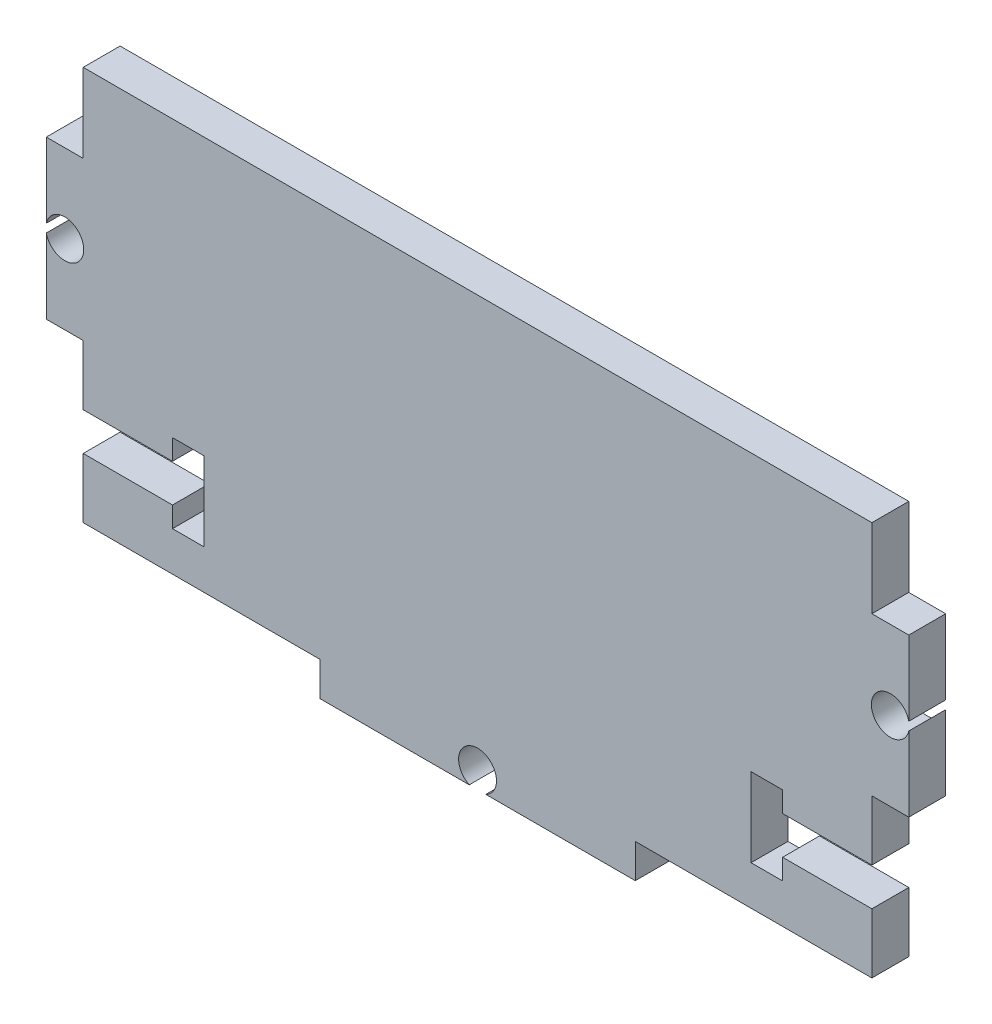
ISO-10303-21;
HEADER;
FILE_DESCRIPTION(('STEP AP214'),'2;1');
FILE_NAME('part.step','',(''),(''),'','','');
FILE_SCHEMA(('AUTOMOTIVE_DESIGN { 1 0 10303 214 1 1 1 1 }'));
ENDSEC;
DATA;
#1=APPLICATION_CONTEXT('core data for automotive mechanical design processes');
#2=APPLICATION_PROTOCOL_DEFINITION('international standard','automotive_design',2000,#1);
#3=PRODUCT_CONTEXT('',#1,'mechanical');
#4=PRODUCT('Part','Part','',(#3));
#5=PRODUCT_RELATED_PRODUCT_CATEGORY('part','',(#4));
#6=PRODUCT_DEFINITION_FORMATION('','',#4);
#7=PRODUCT_DEFINITION_CONTEXT('part definition',#1,'design');
#8=PRODUCT_DEFINITION('design','',#6,#7);
#9=PRODUCT_DEFINITION_SHAPE('','',#8);
#10=(LENGTH_UNIT() NAMED_UNIT(*) SI_UNIT(.MILLI.,.METRE.));
#11=(NAMED_UNIT(*) PLANE_ANGLE_UNIT() SI_UNIT($,.RADIAN.));
#12=(NAMED_UNIT(*) SI_UNIT($,.STERADIAN.) SOLID_ANGLE_UNIT());
#13=UNCERTAINTY_MEASURE_WITH_UNIT(LENGTH_MEASURE(1.E-05),#10,'distance_accuracy_value','');
#14=(GEOMETRIC_REPRESENTATION_CONTEXT(3) GLOBAL_UNCERTAINTY_ASSIGNED_CONTEXT((#13)) GLOBAL_UNIT_ASSIGNED_CONTEXT((#10,
#11,#12)) REPRESENTATION_CONTEXT('',''));
#15=CARTESIAN_POINT('',(0.,0.,0.));
#16=DIRECTION('',(0.,0.,1.));
#17=DIRECTION('',(1.,0.,0.));
#18=AXIS2_PLACEMENT_3D('',#15,#16,#17);
#19=CARTESIAN_POINT('',(-34.7218,0.,2.9718));
#20=DIRECTION('',(1.,0.,0.));
#21=DIRECTION('',(0.,0.,-1.));
#22=AXIS2_PLACEMENT_3D('',#19,#20,#21);
#23=PLANE('',#22);
#24=DIRECTION('',(0.,-1.,0.));
#25=VECTOR('',#24,1.);
#26=CARTESIAN_POINT('',(-34.7218,0.,2.9718));
#27=LINE('',#26,#25);
#28=CARTESIAN_POINT('',(-34.7218,2.83635979270025,2.9718));
#29=VERTEX_POINT('',#28);
#30=CARTESIAN_POINT('',(-34.7218,-3.175,2.9718));
#31=VERTEX_POINT('',#30);
#32=EDGE_CURVE('E605',#29,#31,#27,.T.);
#33=ORIENTED_EDGE('',*,*,#32,.F.);
#34=DIRECTION('',(0.,0.,-1.));
#35=VECTOR('',#34,1.);
#36=CARTESIAN_POINT('',(-34.7218,2.83635979270025,2.9718));
#37=LINE('',#36,#35);
#38=CARTESIAN_POINT('',(-34.7218,2.83635979270025,0.));
#39=VERTEX_POINT('',#38);
#40=EDGE_CURVE('E613',#29,#39,#37,.T.);
#41=ORIENTED_EDGE('',*,*,#40,.T.);
#42=DIRECTION('',(0.,-1.,0.));
#43=VECTOR('',#42,1.);
#44=CARTESIAN_POINT('',(-34.7218,0.,0.));
#45=LINE('',#44,#43);
#46=CARTESIAN_POINT('',(-34.7218,-3.175,0.));
#47=VERTEX_POINT('',#46);
#48=EDGE_CURVE('E479',#39,#47,#45,.T.);
#49=ORIENTED_EDGE('',*,*,#48,.T.);
#50=DIRECTION('',(0.,0.,-1.));
#51=VECTOR('',#50,1.);
#52=CARTESIAN_POINT('',(-34.7218,-3.175,2.9718));
#53=LINE('',#52,#51);
#54=EDGE_CURVE('E57',#31,#47,#53,.T.);
#55=ORIENTED_EDGE('',*,*,#54,.F.);
#56=EDGE_LOOP('',(#33,#41,#49,#55));
#57=FACE_BOUND('',#56,.T.);
#58=ADVANCED_FACE('F48',(#57),#23,.F.);
#59=CARTESIAN_POINT('',(-31.75,0.,2.9718));
#60=DIRECTION('',(-1.,0.,0.));
#61=DIRECTION('',(0.,-1.,0.));
#62=AXIS2_PLACEMENT_3D('',#59,#60,#61);
#63=PLANE('',#62);
#64=DIRECTION('',(0.,1.,0.));
#65=VECTOR('',#64,1.);
#66=CARTESIAN_POINT('',(-31.75,0.,2.9718));
#67=LINE('',#66,#65);
#68=CARTESIAN_POINT('',(-31.75,-15.875,2.9718));
#69=VERTEX_POINT('',#68);
#70=CARTESIAN_POINT('',(-31.75,-11.049,2.9718));
#71=VERTEX_POINT('',#70);
#72=EDGE_CURVE('E544',#69,#71,#67,.T.);
#73=ORIENTED_EDGE('',*,*,#72,.T.);
#74=DIRECTION('',(0.,0.,-1.));
#75=VECTOR('',#74,1.);
#76=CARTESIAN_POINT('',(-31.75,-11.049,2.9718));
#77=LINE('',#76,#75);
#78=CARTESIAN_POINT('',(-31.75,-11.049,0.));
#79=VERTEX_POINT('',#78);
#80=EDGE_CURVE('E797',#71,#79,#77,.T.);
#81=ORIENTED_EDGE('',*,*,#80,.T.);
#82=DIRECTION('',(0.,1.,0.));
#83=VECTOR('',#82,1.);
#84=CARTESIAN_POINT('',(-31.75,0.,0.));
#85=LINE('',#84,#83);
#86=CARTESIAN_POINT('',(-31.75,-15.875,0.));
#87=VERTEX_POINT('',#86);
#88=EDGE_CURVE('E487',#87,#79,#85,.T.);
#89=ORIENTED_EDGE('',*,*,#88,.F.);
#90=DIRECTION('',(0.,0.,-1.));
#91=VECTOR('',#90,1.);
#92=CARTESIAN_POINT('',(-31.75,-15.875,2.9718));
#93=LINE('',#92,#91);
#94=EDGE_CURVE('E458',#69,#87,#93,.T.);
#95=ORIENTED_EDGE('',*,*,#94,.F.);
#96=EDGE_LOOP('',(#73,#81,#89,#95));
#97=FACE_BOUND('',#96,.T.);
#98=ADVANCED_FACE('F622',(#97),#63,.T.);
#99=CARTESIAN_POINT('',(0.,-18.6147342531079,2.9718));
#100=DIRECTION('',(0.,1.,0.));
#101=DIRECTION('',(0.,0.,1.));
#102=AXIS2_PLACEMENT_3D('',#99,#100,#101);
#103=PLANE('',#102);
#104=DIRECTION('',(1.,0.,0.));
#105=VECTOR('',#104,1.);
#106=CARTESIAN_POINT('',(0.,-18.6147342531079,2.9718));
#107=LINE('',#106,#105);
#108=CARTESIAN_POINT('',(0.667862302864053,-18.6147342531079,2.9718));
#109=VERTEX_POINT('',#108);
#110=CARTESIAN_POINT('',(12.7,-18.6147342531079,2.9718));
#111=VERTEX_POINT('',#110);
#112=EDGE_CURVE('E822',#109,#111,#107,.T.);
#113=ORIENTED_EDGE('',*,*,#112,.F.);
#114=DIRECTION('',(0.,0.,-1.));
#115=VECTOR('',#114,1.);
#116=CARTESIAN_POINT('',(0.667862302864053,-18.6147342531079,2.9718));
#117=LINE('',#116,#115);
#118=CARTESIAN_POINT('',(0.667862302864053,-18.6147342531079,0.));
#119=VERTEX_POINT('',#118);
#120=EDGE_CURVE('E731',#109,#119,#117,.T.);
#121=ORIENTED_EDGE('',*,*,#120,.T.);
#122=DIRECTION('',(1.,0.,0.));
#123=VECTOR('',#122,1.);
#124=CARTESIAN_POINT('',(0.,-18.6147342531079,0.));
#125=LINE('',#124,#123);
#126=CARTESIAN_POINT('',(12.7,-18.6147342531079,0.));
#127=VERTEX_POINT('',#126);
#128=EDGE_CURVE('E502',#119,#127,#125,.T.);
#129=ORIENTED_EDGE('',*,*,#128,.T.);
#130=DIRECTION('',(0.,0.,-1.));
#131=VECTOR('',#130,1.);
#132=CARTESIAN_POINT('',(12.7,-18.6147342531079,2.9718));
#133=LINE('',#132,#131);
#134=EDGE_CURVE('E446',#111,#127,#133,.T.);
#135=ORIENTED_EDGE('',*,*,#134,.F.);
#136=EDGE_LOOP('',(#113,#121,#129,#135));
#137=FACE_BOUND('',#136,.T.);
#138=ADVANCED_FACE('F627',(#137),#103,.F.);
#139=CARTESIAN_POINT('',(31.75,0.,2.9718));
#140=DIRECTION('',(-1.,0.,0.));
#141=DIRECTION('',(0.,0.,1.));
#142=AXIS2_PLACEMENT_3D('',#139,#140,#141);
#143=PLANE('',#142);
#144=DIRECTION('',(0.,0.,-1.));
#145=VECTOR('',#144,1.);
#146=CARTESIAN_POINT('',(31.75,-8.00099999999999,2.9718));
#147=LINE('',#146,#145);
#148=CARTESIAN_POINT('',(31.75,-8.00099999999999,2.9718));
#149=VERTEX_POINT('',#148);
#150=CARTESIAN_POINT('',(31.75,-8.00099999999999,0.));
#151=VERTEX_POINT('',#150);
#152=EDGE_CURVE('E695',#149,#151,#147,.T.);
#153=ORIENTED_EDGE('',*,*,#152,.T.);
#154=DIRECTION('',(0.,1.,0.));
#155=VECTOR('',#154,1.);
#156=CARTESIAN_POINT('',(31.75,0.,0.));
#157=LINE('',#156,#155);
#158=CARTESIAN_POINT('',(31.75,-3.175,0.));
#159=VERTEX_POINT('',#158);
#160=EDGE_CURVE('E513',#151,#159,#157,.T.);
#161=ORIENTED_EDGE('',*,*,#160,.T.);
#162=DIRECTION('',(0.,0.,-1.));
#163=VECTOR('',#162,1.);
#164=CARTESIAN_POINT('',(31.75,-3.175,2.9718));
#165=LINE('',#164,#163);
#166=CARTESIAN_POINT('',(31.75,-3.175,2.9718));
#167=VERTEX_POINT('',#166);
#168=EDGE_CURVE('E435',#167,#159,#165,.T.);
#169=ORIENTED_EDGE('',*,*,#168,.F.);
#170=DIRECTION('',(0.,1.,0.));
#171=VECTOR('',#170,1.);
#172=CARTESIAN_POINT('',(31.75,0.,2.9718));
#173=LINE('',#172,#171);
#174=EDGE_CURVE('E549',#149,#167,#173,.T.);
#175=ORIENTED_EDGE('',*,*,#174,.F.);
#176=EDGE_LOOP('',(#153,#161,#169,#175));
#177=FACE_BOUND('',#176,.T.);
#178=ADVANCED_FACE('F870',(#177),#143,.F.);
#179=CARTESIAN_POINT('',(34.7218,0.,2.9718));
#180=DIRECTION('',(1.,0.,0.));
#181=DIRECTION('',(0.,0.,-1.));
#182=AXIS2_PLACEMENT_3D('',#179,#180,#181);
#183=PLANE('',#182);
#184=DIRECTION('',(0.,0.,-1.));
#185=VECTOR('',#184,1.);
#186=CARTESIAN_POINT('',(34.7218,2.83635979270025,2.9718));
#187=LINE('',#186,#185);
#188=CARTESIAN_POINT('',(34.7218,2.83635979270025,2.9718));
#189=VERTEX_POINT('',#188);
#190=CARTESIAN_POINT('',(34.7218,2.83635979270025,0.));
#191=VERTEX_POINT('',#190);
#192=EDGE_CURVE('E375',#189,#191,#187,.T.);
#193=ORIENTED_EDGE('',*,*,#192,.F.);
#194=DIRECTION('',(0.,-1.,0.));
#195=VECTOR('',#194,1.);
#196=CARTESIAN_POINT('',(34.7218,0.,2.9718));
#197=LINE('',#196,#195);
#198=CARTESIAN_POINT('',(34.7218,-3.175,2.9718));
#199=VERTEX_POINT('',#198);
#200=EDGE_CURVE('E849',#189,#199,#197,.T.);
#201=ORIENTED_EDGE('',*,*,#200,.T.);
#202=DIRECTION('',(0.,0.,-1.));
#203=VECTOR('',#202,1.);
#204=CARTESIAN_POINT('',(34.7218,-3.175,2.9718));
#205=LINE('',#204,#203);
#206=CARTESIAN_POINT('',(34.7218,-3.175,0.));
#207=VERTEX_POINT('',#206);
#208=EDGE_CURVE('E431',#199,#207,#205,.T.);
#209=ORIENTED_EDGE('',*,*,#208,.T.);
#210=DIRECTION('',(0.,-1.,0.));
#211=VECTOR('',#210,1.);
#212=CARTESIAN_POINT('',(34.7218,0.,0.));
#213=LINE('',#212,#211);
#214=EDGE_CURVE('E400',#191,#207,#213,.T.);
#215=ORIENTED_EDGE('',*,*,#214,.F.);
#216=EDGE_LOOP('',(#193,#201,#209,#215));
#217=FACE_BOUND('',#216,.T.);
#218=ADVANCED_FACE('F867',(#217),#183,.T.);
#219=CARTESIAN_POINT('',(0.,0.,2.9718));
#220=DIRECTION('',(0.,0.,1.));
#221=DIRECTION('',(1.,0.,0.));
#222=AXIS2_PLACEMENT_3D('',#219,#220,#221);
#223=PLANE('',#222);
#224=DIRECTION('',(0.,1.,0.));
#225=VECTOR('',#224,1.);
#226=CARTESIAN_POINT('',(-24.5618,-12.7,2.9718));
#227=LINE('',#226,#225);
#228=CARTESIAN_POINT('',(-24.5618,-12.7,2.9718));
#229=VERTEX_POINT('',#228);
#230=CARTESIAN_POINT('',(-24.5618,-11.049,2.9718));
#231=VERTEX_POINT('',#230);
#232=EDGE_CURVE('E771',#229,#231,#227,.T.);
#233=ORIENTED_EDGE('',*,*,#232,.T.);
#234=DIRECTION('',(1.,0.,0.));
#235=VECTOR('',#234,1.);
#236=CARTESIAN_POINT('',(-31.75,-11.049,2.9718));
#237=LINE('',#236,#235);
#238=EDGE_CURVE('E774',#71,#231,#237,.T.);
#239=ORIENTED_EDGE('',*,*,#238,.F.);
#240=ORIENTED_EDGE('',*,*,#72,.F.);
#241=DIRECTION('',(1.,0.,0.));
#242=VECTOR('',#241,1.);
#243=CARTESIAN_POINT('',(0.,-15.875,2.9718));
#244=LINE('',#243,#242);
#245=CARTESIAN_POINT('',(-12.7,-15.875,2.9718));
#246=VERTEX_POINT('',#245);
#247=EDGE_CURVE('E567',#69,#246,#244,.T.);
#248=ORIENTED_EDGE('',*,*,#247,.T.);
#249=DIRECTION('',(0.,-1.,0.));
#250=VECTOR('',#249,1.);
#251=CARTESIAN_POINT('',(-12.7,0.,2.9718));
#252=LINE('',#251,#250);
#253=CARTESIAN_POINT('',(-12.7,-18.6147342531079,2.9718));
#254=VERTEX_POINT('',#253);
#255=EDGE_CURVE('E823',#246,#254,#252,.T.);
#256=ORIENTED_EDGE('',*,*,#255,.T.);
#257=CARTESIAN_POINT('',(-0.667862302864053,-18.6147342531079,2.9718));
#258=VERTEX_POINT('',#257);
#259=EDGE_CURVE('E817',#254,#258,#107,.T.);
#260=ORIENTED_EDGE('',*,*,#259,.T.);
#261=CARTESIAN_POINT('',(0.,-17.2448671265539,2.9718));
#262=DIRECTION('',(0.,0.,-1.));
#263=DIRECTION('',(-1.,0.,0.));
#264=AXIS2_PLACEMENT_3D('',#261,#262,#263);
#265=CIRCLE('',#264,1.524);
#266=EDGE_CURVE('E724',#258,#109,#265,.T.);
#267=ORIENTED_EDGE('',*,*,#266,.T.);
#268=ORIENTED_EDGE('',*,*,#112,.T.);
#269=DIRECTION('',(0.,-1.,0.));
#270=VECTOR('',#269,1.);
#271=CARTESIAN_POINT('',(12.7,0.,2.9718));
#272=LINE('',#271,#270);
#273=CARTESIAN_POINT('',(12.7,-15.875,2.9718));
#274=VERTEX_POINT('',#273);
#275=EDGE_CURVE('E821',#274,#111,#272,.T.);
#276=ORIENTED_EDGE('',*,*,#275,.F.);
#277=CARTESIAN_POINT('',(31.75,-15.875,2.9718));
#278=VERTEX_POINT('',#277);
#279=EDGE_CURVE('E829',#274,#278,#244,.T.);
#280=ORIENTED_EDGE('',*,*,#279,.T.);
#281=CARTESIAN_POINT('',(31.75,-11.049,2.9718));
#282=VERTEX_POINT('',#281);
#283=EDGE_CURVE('E548',#278,#282,#173,.T.);
#284=ORIENTED_EDGE('',*,*,#283,.T.);
#285=DIRECTION('',(-1.,0.,0.));
#286=VECTOR('',#285,1.);
#287=CARTESIAN_POINT('',(0.,-11.049,2.9718));
#288=LINE('',#287,#286);
#289=CARTESIAN_POINT('',(24.5618,-11.049,2.9718));
#290=VERTEX_POINT('',#289);
#291=EDGE_CURVE('E674',#282,#290,#288,.T.);
#292=ORIENTED_EDGE('',*,*,#291,.T.);
#293=DIRECTION('',(0.,1.,0.));
#294=VECTOR('',#293,1.);
#295=CARTESIAN_POINT('',(24.5618,0.,2.9718));
#296=LINE('',#295,#294);
#297=CARTESIAN_POINT('',(24.5618,-12.7,2.9718));
#298=VERTEX_POINT('',#297);
#299=EDGE_CURVE('E678',#298,#290,#296,.T.);
#300=ORIENTED_EDGE('',*,*,#299,.F.);
#301=DIRECTION('',(1.,0.,0.));
#302=VECTOR('',#301,1.);
#303=CARTESIAN_POINT('',(0.,-12.7,2.9718));
#304=LINE('',#303,#302);
#305=CARTESIAN_POINT('',(22.0218,-12.7,2.9718));
#306=VERTEX_POINT('',#305);
#307=EDGE_CURVE('E681',#306,#298,#304,.T.);
#308=ORIENTED_EDGE('',*,*,#307,.F.);
#309=DIRECTION('',(0.,1.,0.));
#310=VECTOR('',#309,1.);
#311=CARTESIAN_POINT('',(22.0218,0.,2.9718));
#312=LINE('',#311,#310);
#313=CARTESIAN_POINT('',(22.0218,-6.34999999999999,2.9718));
#314=VERTEX_POINT('',#313);
#315=EDGE_CURVE('E684',#306,#314,#312,.T.);
#316=ORIENTED_EDGE('',*,*,#315,.T.);
#317=DIRECTION('',(1.,0.,0.));
#318=VECTOR('',#317,1.);
#319=CARTESIAN_POINT('',(0.,-6.34999999999999,2.9718));
#320=LINE('',#319,#318);
#321=CARTESIAN_POINT('',(24.5618,-6.34999999999999,2.9718));
#322=VERTEX_POINT('',#321);
#323=EDGE_CURVE('E688',#314,#322,#320,.T.);
#324=ORIENTED_EDGE('',*,*,#323,.T.);
#325=DIRECTION('',(0.,1.,0.));
#326=VECTOR('',#325,1.);
#327=CARTESIAN_POINT('',(24.5618,0.,2.9718));
#328=LINE('',#327,#326);
#329=CARTESIAN_POINT('',(24.5618,-8.00099999999999,2.9718));
#330=VERTEX_POINT('',#329);
#331=EDGE_CURVE('E692',#330,#322,#328,.T.);
#332=ORIENTED_EDGE('',*,*,#331,.F.);
#333=DIRECTION('',(-1.,0.,0.));
#334=VECTOR('',#333,1.);
#335=CARTESIAN_POINT('',(0.,-8.00099999999999,2.9718));
#336=LINE('',#335,#334);
#337=EDGE_CURVE('E671',#149,#330,#336,.T.);
#338=ORIENTED_EDGE('',*,*,#337,.F.);
#339=ORIENTED_EDGE('',*,*,#174,.T.);
#340=DIRECTION('',(1.,0.,0.));
#341=VECTOR('',#340,1.);
#342=CARTESIAN_POINT('',(0.,-3.175,2.9718));
#343=LINE('',#342,#341);
#344=EDGE_CURVE('E834',#167,#199,#343,.T.);
#345=ORIENTED_EDGE('',*,*,#344,.T.);
#346=ORIENTED_EDGE('',*,*,#200,.F.);
#347=CARTESIAN_POINT('',(33.2359,3.175,2.9718));
#348=DIRECTION('',(0.,0.,-1.));
#349=DIRECTION('',(-1.,0.,0.));
#350=AXIS2_PLACEMENT_3D('',#347,#348,#349);
#351=CIRCLE('',#350,1.524);
#352=CARTESIAN_POINT('',(34.7218,3.51364020729976,2.9718));
#353=VERTEX_POINT('',#352);
#354=EDGE_CURVE('E381',#189,#353,#351,.T.);
#355=ORIENTED_EDGE('',*,*,#354,.T.);
#356=CARTESIAN_POINT('',(34.7218,9.525,2.9718));
#357=VERTEX_POINT('',#356);
#358=EDGE_CURVE('E390',#357,#353,#197,.T.);
#359=ORIENTED_EDGE('',*,*,#358,.F.);
#360=DIRECTION('',(1.,0.,0.));
#361=VECTOR('',#360,1.);
#362=CARTESIAN_POINT('',(0.,9.525,2.9718));
#363=LINE('',#362,#361);
#364=CARTESIAN_POINT('',(31.75,9.525,2.9718));
#365=VERTEX_POINT('',#364);
#366=EDGE_CURVE('E546',#365,#357,#363,.T.);
#367=ORIENTED_EDGE('',*,*,#366,.F.);
#368=CARTESIAN_POINT('',(31.75,15.875,2.9718));
#369=VERTEX_POINT('',#368);
#370=EDGE_CURVE('E539',#365,#369,#173,.T.);
#371=ORIENTED_EDGE('',*,*,#370,.T.);
#372=DIRECTION('',(1.,0.,0.));
#373=VECTOR('',#372,1.);
#374=CARTESIAN_POINT('',(0.,15.875,2.9718));
#375=LINE('',#374,#373);
#376=CARTESIAN_POINT('',(-31.75,15.875,2.9718));
#377=VERTEX_POINT('',#376);
#378=EDGE_CURVE('E534',#377,#369,#375,.T.);
#379=ORIENTED_EDGE('',*,*,#378,.F.);
#380=CARTESIAN_POINT('',(-31.75,9.525,2.9718));
#381=VERTEX_POINT('',#380);
#382=EDGE_CURVE('E419',#381,#377,#67,.T.);
#383=ORIENTED_EDGE('',*,*,#382,.F.);
#384=DIRECTION('',(-1.,0.,0.));
#385=VECTOR('',#384,1.);
#386=CARTESIAN_POINT('',(0.,9.525,2.9718));
#387=LINE('',#386,#385);
#388=CARTESIAN_POINT('',(-34.7218,9.525,2.9718));
#389=VERTEX_POINT('',#388);
#390=EDGE_CURVE('E606',#381,#389,#387,.T.);
#391=ORIENTED_EDGE('',*,*,#390,.T.);
#392=CARTESIAN_POINT('',(-34.7218,3.51364020729976,2.9718));
#393=VERTEX_POINT('',#392);
#394=EDGE_CURVE('E601',#389,#393,#27,.T.);
#395=ORIENTED_EDGE('',*,*,#394,.T.);
#396=CARTESIAN_POINT('',(-33.2359,3.175,2.9718));
#397=DIRECTION('',(0.,0.,-1.));
#398=DIRECTION('',(-1.,0.,0.));
#399=AXIS2_PLACEMENT_3D('',#396,#397,#398);
#400=CIRCLE('',#399,1.524);
#401=EDGE_CURVE('E594',#393,#29,#400,.T.);
#402=ORIENTED_EDGE('',*,*,#401,.T.);
#403=ORIENTED_EDGE('',*,*,#32,.T.);
#404=DIRECTION('',(-1.,0.,0.));
#405=VECTOR('',#404,1.);
#406=CARTESIAN_POINT('',(0.,-3.175,2.9718));
#407=LINE('',#406,#405);
#408=CARTESIAN_POINT('',(-31.75,-3.175,2.9718));
#409=VERTEX_POINT('',#408);
#410=EDGE_CURVE('E475',#409,#31,#407,.T.);
#411=ORIENTED_EDGE('',*,*,#410,.F.);
#412=CARTESIAN_POINT('',(-31.75,-8.001,2.9718));
#413=VERTEX_POINT('',#412);
#414=EDGE_CURVE('E545',#413,#409,#67,.T.);
#415=ORIENTED_EDGE('',*,*,#414,.F.);
#416=DIRECTION('',(1.,0.,0.));
#417=VECTOR('',#416,1.);
#418=CARTESIAN_POINT('',(-31.75,-8.001,2.9718));
#419=LINE('',#418,#417);
#420=CARTESIAN_POINT('',(-24.5618,-8.001,2.9718));
#421=VERTEX_POINT('',#420);
#422=EDGE_CURVE('E585',#413,#421,#419,.T.);
#423=ORIENTED_EDGE('',*,*,#422,.T.);
#424=DIRECTION('',(0.,1.,0.));
#425=VECTOR('',#424,1.);
#426=CARTESIAN_POINT('',(-24.5618,-8.001,2.9718));
#427=LINE('',#426,#425);
#428=CARTESIAN_POINT('',(-24.5618,-6.35,2.9718));
#429=VERTEX_POINT('',#428);
#430=EDGE_CURVE('E591',#421,#429,#427,.T.);
#431=ORIENTED_EDGE('',*,*,#430,.T.);
#432=DIRECTION('',(-1.,0.,0.));
#433=VECTOR('',#432,1.);
#434=CARTESIAN_POINT('',(-22.0218,-6.35,2.9718));
#435=LINE('',#434,#433);
#436=CARTESIAN_POINT('',(-22.0218,-6.35,2.9718));
#437=VERTEX_POINT('',#436);
#438=EDGE_CURVE('E763',#437,#429,#435,.T.);
#439=ORIENTED_EDGE('',*,*,#438,.F.);
#440=DIRECTION('',(0.,1.,0.));
#441=VECTOR('',#440,1.);
#442=CARTESIAN_POINT('',(-22.0218,-12.7,2.9718));
#443=LINE('',#442,#441);
#444=CARTESIAN_POINT('',(-22.0218,-12.7,2.9718));
#445=VERTEX_POINT('',#444);
#446=EDGE_CURVE('E765',#445,#437,#443,.T.);
#447=ORIENTED_EDGE('',*,*,#446,.F.);
#448=DIRECTION('',(-1.,0.,0.));
#449=VECTOR('',#448,1.);
#450=CARTESIAN_POINT('',(-22.0218,-12.7,2.9718));
#451=LINE('',#450,#449);
#452=EDGE_CURVE('E767',#445,#229,#451,.T.);
#453=ORIENTED_EDGE('',*,*,#452,.T.);
#454=EDGE_LOOP('',(#233,#239,#240,#248,#256,#260,#267,#268,#276,#280,#284,#292,#300,#308,#316,
#324,#332,#338,#339,#345,#346,#355,#359,#367,#371,#379,#383,#391,#395,#402,#403,#411,#415,#423,
#431,#439,#447,#453));
#455=FACE_BOUND('',#454,.T.);
#456=ADVANCED_FACE('F860',(#455),#223,.T.);
#457=CARTESIAN_POINT('',(0.,0.,0.));
#458=DIRECTION('',(0.,0.,1.));
#459=DIRECTION('',(1.,0.,0.));
#460=AXIS2_PLACEMENT_3D('',#457,#458,#459);
#461=PLANE('',#460);
#462=DIRECTION('',(1.,0.,0.));
#463=VECTOR('',#462,1.);
#464=CARTESIAN_POINT('',(-31.75,-11.049,0.));
#465=LINE('',#464,#463);
#466=CARTESIAN_POINT('',(-24.5618,-11.049,0.));
#467=VERTEX_POINT('',#466);
#468=EDGE_CURVE('E590',#79,#467,#465,.T.);
#469=ORIENTED_EDGE('',*,*,#468,.T.);
#470=DIRECTION('',(0.,1.,0.));
#471=VECTOR('',#470,1.);
#472=CARTESIAN_POINT('',(-24.5618,-12.7,0.));
#473=LINE('',#472,#471);
#474=CARTESIAN_POINT('',(-24.5618,-12.7,0.));
#475=VERTEX_POINT('',#474);
#476=EDGE_CURVE('E754',#475,#467,#473,.T.);
#477=ORIENTED_EDGE('',*,*,#476,.F.);
#478=DIRECTION('',(-1.,0.,0.));
#479=VECTOR('',#478,1.);
#480=CARTESIAN_POINT('',(-22.0218,-12.7,0.));
#481=LINE('',#480,#479);
#482=CARTESIAN_POINT('',(-22.0218,-12.7,0.));
#483=VERTEX_POINT('',#482);
#484=EDGE_CURVE('E750',#483,#475,#481,.T.);
#485=ORIENTED_EDGE('',*,*,#484,.F.);
#486=DIRECTION('',(0.,1.,0.));
#487=VECTOR('',#486,1.);
#488=CARTESIAN_POINT('',(-22.0218,-12.7,0.));
#489=LINE('',#488,#487);
#490=CARTESIAN_POINT('',(-22.0218,-6.35,0.));
#491=VERTEX_POINT('',#490);
#492=EDGE_CURVE('E746',#483,#491,#489,.T.);
#493=ORIENTED_EDGE('',*,*,#492,.T.);
#494=DIRECTION('',(-1.,0.,0.));
#495=VECTOR('',#494,1.);
#496=CARTESIAN_POINT('',(-22.0218,-6.35,0.));
#497=LINE('',#496,#495);
#498=CARTESIAN_POINT('',(-24.5618,-6.35,0.));
#499=VERTEX_POINT('',#498);
#500=EDGE_CURVE('E742',#491,#499,#497,.T.);
#501=ORIENTED_EDGE('',*,*,#500,.T.);
#502=DIRECTION('',(0.,1.,0.));
#503=VECTOR('',#502,1.);
#504=CARTESIAN_POINT('',(-24.5618,-8.001,0.));
#505=LINE('',#504,#503);
#506=CARTESIAN_POINT('',(-24.5618,-8.001,0.));
#507=VERTEX_POINT('',#506);
#508=EDGE_CURVE('E738',#507,#499,#505,.T.);
#509=ORIENTED_EDGE('',*,*,#508,.F.);
#510=DIRECTION('',(1.,0.,0.));
#511=VECTOR('',#510,1.);
#512=CARTESIAN_POINT('',(-31.75,-8.001,0.));
#513=LINE('',#512,#511);
#514=CARTESIAN_POINT('',(-31.75,-8.001,0.));
#515=VERTEX_POINT('',#514);
#516=EDGE_CURVE('E735',#515,#507,#513,.T.);
#517=ORIENTED_EDGE('',*,*,#516,.F.);
#518=CARTESIAN_POINT('',(-31.75,-3.175,0.));
#519=VERTEX_POINT('',#518);
#520=EDGE_CURVE('E481',#515,#519,#85,.T.);
#521=ORIENTED_EDGE('',*,*,#520,.T.);
#522=DIRECTION('',(-1.,0.,0.));
#523=VECTOR('',#522,1.);
#524=CARTESIAN_POINT('',(0.,-3.175,0.));
#525=LINE('',#524,#523);
#526=EDGE_CURVE('E473',#519,#47,#525,.T.);
#527=ORIENTED_EDGE('',*,*,#526,.T.);
#528=ORIENTED_EDGE('',*,*,#48,.F.);
#529=CARTESIAN_POINT('',(-33.2359,3.175,0.));
#530=DIRECTION('',(0.,0.,-1.));
#531=DIRECTION('',(-1.,0.,0.));
#532=AXIS2_PLACEMENT_3D('',#529,#530,#531);
#533=CIRCLE('',#532,1.524);
#534=CARTESIAN_POINT('',(-34.7218,3.51364020729976,0.));
#535=VERTEX_POINT('',#534);
#536=EDGE_CURVE('E380',#535,#39,#533,.T.);
#537=ORIENTED_EDGE('',*,*,#536,.F.);
#538=CARTESIAN_POINT('',(-34.7218,9.525,0.));
#539=VERTEX_POINT('',#538);
#540=EDGE_CURVE('E483',#539,#535,#45,.T.);
#541=ORIENTED_EDGE('',*,*,#540,.F.);
#542=DIRECTION('',(-1.,0.,0.));
#543=VECTOR('',#542,1.);
#544=CARTESIAN_POINT('',(0.,9.525,0.));
#545=LINE('',#544,#543);
#546=CARTESIAN_POINT('',(-31.75,9.525,0.));
#547=VERTEX_POINT('',#546);
#548=EDGE_CURVE('E554',#547,#539,#545,.T.);
#549=ORIENTED_EDGE('',*,*,#548,.F.);
#550=CARTESIAN_POINT('',(-31.75,15.875,0.));
#551=VERTEX_POINT('',#550);
#552=EDGE_CURVE('E414',#547,#551,#85,.T.);
#553=ORIENTED_EDGE('',*,*,#552,.T.);
#554=DIRECTION('',(1.,0.,0.));
#555=VECTOR('',#554,1.);
#556=CARTESIAN_POINT('',(0.,15.875,0.));
#557=LINE('',#556,#555);
#558=CARTESIAN_POINT('',(31.75,15.875,0.));
#559=VERTEX_POINT('',#558);
#560=EDGE_CURVE('E410',#551,#559,#557,.T.);
#561=ORIENTED_EDGE('',*,*,#560,.T.);
#562=CARTESIAN_POINT('',(31.75,9.525,0.));
#563=VERTEX_POINT('',#562);
#564=EDGE_CURVE('E404',#563,#559,#157,.T.);
#565=ORIENTED_EDGE('',*,*,#564,.F.);
#566=DIRECTION('',(1.,0.,0.));
#567=VECTOR('',#566,1.);
#568=CARTESIAN_POINT('',(0.,9.525,0.));
#569=LINE('',#568,#567);
#570=CARTESIAN_POINT('',(34.7218,9.525,0.));
#571=VERTEX_POINT('',#570);
#572=EDGE_CURVE('E398',#563,#571,#569,.T.);
#573=ORIENTED_EDGE('',*,*,#572,.T.);
#574=CARTESIAN_POINT('',(34.7218,3.51364020729976,0.));
#575=VERTEX_POINT('',#574);
#576=EDGE_CURVE('E387',#571,#575,#213,.T.);
#577=ORIENTED_EDGE('',*,*,#576,.T.);
#578=CARTESIAN_POINT('',(33.2359,3.175,0.));
#579=DIRECTION('',(0.,0.,-1.));
#580=DIRECTION('',(-1.,0.,0.));
#581=AXIS2_PLACEMENT_3D('',#578,#579,#580);
#582=CIRCLE('',#581,1.524);
#583=EDGE_CURVE('E369',#191,#575,#582,.T.);
#584=ORIENTED_EDGE('',*,*,#583,.F.);
#585=ORIENTED_EDGE('',*,*,#214,.T.);
#586=DIRECTION('',(1.,0.,0.));
#587=VECTOR('',#586,1.);
#588=CARTESIAN_POINT('',(0.,-3.175,0.));
#589=LINE('',#588,#587);
#590=EDGE_CURVE('E406',#159,#207,#589,.T.);
#591=ORIENTED_EDGE('',*,*,#590,.F.);
#592=ORIENTED_EDGE('',*,*,#160,.F.);
#593=DIRECTION('',(-1.,0.,0.));
#594=VECTOR('',#593,1.);
#595=CARTESIAN_POINT('',(0.,-8.00099999999999,0.));
#596=LINE('',#595,#594);
#597=CARTESIAN_POINT('',(24.5618,-8.00099999999999,0.));
#598=VERTEX_POINT('',#597);
#599=EDGE_CURVE('E392',#151,#598,#596,.T.);
#600=ORIENTED_EDGE('',*,*,#599,.T.);
#601=DIRECTION('',(0.,1.,0.));
#602=VECTOR('',#601,1.);
#603=CARTESIAN_POINT('',(24.5618,0.,0.));
#604=LINE('',#603,#602);
#605=CARTESIAN_POINT('',(24.5618,-6.34999999999999,0.));
#606=VERTEX_POINT('',#605);
#607=EDGE_CURVE('E667',#598,#606,#604,.T.);
#608=ORIENTED_EDGE('',*,*,#607,.T.);
#609=DIRECTION('',(1.,0.,0.));
#610=VECTOR('',#609,1.);
#611=CARTESIAN_POINT('',(0.,-6.34999999999999,0.));
#612=LINE('',#611,#610);
#613=CARTESIAN_POINT('',(22.0218,-6.34999999999999,0.));
#614=VERTEX_POINT('',#613);
#615=EDGE_CURVE('E663',#614,#606,#612,.T.);
#616=ORIENTED_EDGE('',*,*,#615,.F.);
#617=DIRECTION('',(0.,1.,0.));
#618=VECTOR('',#617,1.);
#619=CARTESIAN_POINT('',(22.0218,0.,0.));
#620=LINE('',#619,#618);
#621=CARTESIAN_POINT('',(22.0218,-12.7,0.));
#622=VERTEX_POINT('',#621);
#623=EDGE_CURVE('E659',#622,#614,#620,.T.);
#624=ORIENTED_EDGE('',*,*,#623,.F.);
#625=DIRECTION('',(1.,0.,0.));
#626=VECTOR('',#625,1.);
#627=CARTESIAN_POINT('',(0.,-12.7,0.));
#628=LINE('',#627,#626);
#629=CARTESIAN_POINT('',(24.5618,-12.7,0.));
#630=VERTEX_POINT('',#629);
#631=EDGE_CURVE('E655',#622,#630,#628,.T.);
#632=ORIENTED_EDGE('',*,*,#631,.T.);
#633=DIRECTION('',(0.,1.,0.));
#634=VECTOR('',#633,1.);
#635=CARTESIAN_POINT('',(24.5618,0.,0.));
#636=LINE('',#635,#634);
#637=CARTESIAN_POINT('',(24.5618,-11.049,0.));
#638=VERTEX_POINT('',#637);
#639=EDGE_CURVE('E651',#630,#638,#636,.T.);
#640=ORIENTED_EDGE('',*,*,#639,.T.);
#641=DIRECTION('',(-1.,0.,0.));
#642=VECTOR('',#641,1.);
#643=CARTESIAN_POINT('',(0.,-11.049,0.));
#644=LINE('',#643,#642);
#645=CARTESIAN_POINT('',(31.75,-11.049,0.));
#646=VERTEX_POINT('',#645);
#647=EDGE_CURVE('E647',#646,#638,#644,.T.);
#648=ORIENTED_EDGE('',*,*,#647,.F.);
#649=CARTESIAN_POINT('',(31.75,-15.875,0.));
#650=VERTEX_POINT('',#649);
#651=EDGE_CURVE('E510',#650,#646,#157,.T.);
#652=ORIENTED_EDGE('',*,*,#651,.F.);
#653=DIRECTION('',(1.,0.,0.));
#654=VECTOR('',#653,1.);
#655=CARTESIAN_POINT('',(0.,-15.875,0.));
#656=LINE('',#655,#654);
#657=CARTESIAN_POINT('',(12.7,-15.875,0.));
#658=VERTEX_POINT('',#657);
#659=EDGE_CURVE('E499',#658,#650,#656,.T.);
#660=ORIENTED_EDGE('',*,*,#659,.F.);
#661=DIRECTION('',(0.,-1.,0.));
#662=VECTOR('',#661,1.);
#663=CARTESIAN_POINT('',(12.7,0.,0.));
#664=LINE('',#663,#662);
#665=EDGE_CURVE('E507',#658,#127,#664,.T.);
#666=ORIENTED_EDGE('',*,*,#665,.T.);
#667=ORIENTED_EDGE('',*,*,#128,.F.);
#668=CARTESIAN_POINT('',(0.,-17.2448671265539,0.));
#669=DIRECTION('',(0.,0.,-1.));
#670=DIRECTION('',(-1.,0.,0.));
#671=AXIS2_PLACEMENT_3D('',#668,#669,#670);
#672=CIRCLE('',#671,1.524);
#673=CARTESIAN_POINT('',(-0.667862302864053,-18.6147342531079,0.));
#674=VERTEX_POINT('',#673);
#675=EDGE_CURVE('E721',#674,#119,#672,.T.);
#676=ORIENTED_EDGE('',*,*,#675,.F.);
#677=CARTESIAN_POINT('',(-12.7,-18.6147342531079,0.));
#678=VERTEX_POINT('',#677);
#679=EDGE_CURVE('E503',#678,#674,#125,.T.);
#680=ORIENTED_EDGE('',*,*,#679,.F.);
#681=DIRECTION('',(0.,-1.,0.));
#682=VECTOR('',#681,1.);
#683=CARTESIAN_POINT('',(-12.7,0.,0.));
#684=LINE('',#683,#682);
#685=CARTESIAN_POINT('',(-12.7,-15.875,0.));
#686=VERTEX_POINT('',#685);
#687=EDGE_CURVE('E498',#686,#678,#684,.T.);
#688=ORIENTED_EDGE('',*,*,#687,.F.);
#689=EDGE_CURVE('E495',#87,#686,#656,.T.);
#690=ORIENTED_EDGE('',*,*,#689,.F.);
#691=ORIENTED_EDGE('',*,*,#88,.T.);
#692=EDGE_LOOP('',(#469,#477,#485,#493,#501,#509,#517,#521,#527,#528,#537,#541,#549,#553,#561,
#565,#573,#577,#584,#585,#591,#592,#600,#608,#616,#624,#632,#640,#648,#652,#660,#666,#667,#676,
#680,#688,#690,#691));
#693=FACE_BOUND('',#692,.T.);
#694=ADVANCED_FACE('F395',(#693),#461,.F.);
#695=CARTESIAN_POINT('',(0.,9.525,2.9718));
#696=DIRECTION('',(0.,-1.,0.));
#697=DIRECTION('',(0.,0.,-1.));
#698=AXIS2_PLACEMENT_3D('',#695,#696,#697);
#699=PLANE('',#698);
#700=ORIENTED_EDGE('',*,*,#548,.T.);
#701=DIRECTION('',(0.,0.,-1.));
#702=VECTOR('',#701,1.);
#703=CARTESIAN_POINT('',(-34.7218,9.525,2.9718));
#704=LINE('',#703,#702);
#705=EDGE_CURVE('E12',#389,#539,#704,.T.);
#706=ORIENTED_EDGE('',*,*,#705,.F.);
#707=ORIENTED_EDGE('',*,*,#390,.F.);
#708=DIRECTION('',(0.,0.,-1.));
#709=VECTOR('',#708,1.);
#710=CARTESIAN_POINT('',(-31.75,9.525,2.9718));
#711=LINE('',#710,#709);
#712=EDGE_CURVE('E415',#381,#547,#711,.T.);
#713=ORIENTED_EDGE('',*,*,#712,.T.);
#714=EDGE_LOOP('',(#700,#706,#707,#713));
#715=FACE_BOUND('',#714,.T.);
#716=ADVANCED_FACE('F50',(#715),#699,.F.);
#717=ORIENTED_EDGE('',*,*,#540,.T.);
#718=DIRECTION('',(0.,0.,-1.));
#719=VECTOR('',#718,1.);
#720=CARTESIAN_POINT('',(-34.7218,3.51364020729976,2.9718));
#721=LINE('',#720,#719);
#722=EDGE_CURVE('E67',#393,#535,#721,.T.);
#723=ORIENTED_EDGE('',*,*,#722,.F.);
#724=ORIENTED_EDGE('',*,*,#394,.F.);
#725=ORIENTED_EDGE('',*,*,#705,.T.);
#726=EDGE_LOOP('',(#717,#723,#724,#725));
#727=FACE_BOUND('',#726,.T.);
#728=ADVANCED_FACE('F623',(#727),#23,.F.);
#729=CARTESIAN_POINT('',(0.,-3.175,2.9718));
#730=DIRECTION('',(0.,-1.,0.));
#731=DIRECTION('',(0.,0.,-1.));
#732=AXIS2_PLACEMENT_3D('',#729,#730,#731);
#733=PLANE('',#732);
#734=ORIENTED_EDGE('',*,*,#526,.F.);
#735=DIRECTION('',(0.,0.,-1.));
#736=VECTOR('',#735,1.);
#737=CARTESIAN_POINT('',(-31.75,-3.175,2.9718));
#738=LINE('',#737,#736);
#739=EDGE_CURVE('E461',#409,#519,#738,.T.);
#740=ORIENTED_EDGE('',*,*,#739,.F.);
#741=ORIENTED_EDGE('',*,*,#410,.T.);
#742=ORIENTED_EDGE('',*,*,#54,.T.);
#743=EDGE_LOOP('',(#734,#740,#741,#742));
#744=FACE_BOUND('',#743,.T.);
#745=ADVANCED_FACE('F471',(#744),#733,.T.);
#746=DIRECTION('',(0.,0.,-1.));
#747=VECTOR('',#746,1.);
#748=CARTESIAN_POINT('',(-31.75,-8.001,2.9718));
#749=LINE('',#748,#747);
#750=EDGE_CURVE('E78',#413,#515,#749,.T.);
#751=ORIENTED_EDGE('',*,*,#750,.F.);
#752=ORIENTED_EDGE('',*,*,#414,.T.);
#753=ORIENTED_EDGE('',*,*,#739,.T.);
#754=ORIENTED_EDGE('',*,*,#520,.F.);
#755=EDGE_LOOP('',(#751,#752,#753,#754));
#756=FACE_BOUND('',#755,.T.);
#757=ADVANCED_FACE('F630',(#756),#63,.T.);
#758=CARTESIAN_POINT('',(0.,-15.875,2.9718));
#759=DIRECTION('',(0.,1.,0.));
#760=DIRECTION('',(0.,0.,1.));
#761=AXIS2_PLACEMENT_3D('',#758,#759,#760);
#762=PLANE('',#761);
#763=ORIENTED_EDGE('',*,*,#689,.T.);
#764=DIRECTION('',(0.,0.,-1.));
#765=VECTOR('',#764,1.);
#766=CARTESIAN_POINT('',(-12.7,-15.875,2.9718));
#767=LINE('',#766,#765);
#768=EDGE_CURVE('E454',#246,#686,#767,.T.);
#769=ORIENTED_EDGE('',*,*,#768,.F.);
#770=ORIENTED_EDGE('',*,*,#247,.F.);
#771=ORIENTED_EDGE('',*,*,#94,.T.);
#772=EDGE_LOOP('',(#763,#769,#770,#771));
#773=FACE_BOUND('',#772,.T.);
#774=ADVANCED_FACE('F926',(#773),#762,.F.);
#775=CARTESIAN_POINT('',(-12.7,0.,2.9718));
#776=DIRECTION('',(1.,0.,0.));
#777=DIRECTION('',(0.,0.,-1.));
#778=AXIS2_PLACEMENT_3D('',#775,#776,#777);
#779=PLANE('',#778);
#780=ORIENTED_EDGE('',*,*,#687,.T.);
#781=DIRECTION('',(0.,0.,-1.));
#782=VECTOR('',#781,1.);
#783=CARTESIAN_POINT('',(-12.7,-18.6147342531079,2.9718));
#784=LINE('',#783,#782);
#785=EDGE_CURVE('E450',#254,#678,#784,.T.);
#786=ORIENTED_EDGE('',*,*,#785,.F.);
#787=ORIENTED_EDGE('',*,*,#255,.F.);
#788=ORIENTED_EDGE('',*,*,#768,.T.);
#789=EDGE_LOOP('',(#780,#786,#787,#788));
#790=FACE_BOUND('',#789,.T.);
#791=ADVANCED_FACE('F927',(#790),#779,.F.);
#792=ORIENTED_EDGE('',*,*,#679,.T.);
#793=DIRECTION('',(0.,0.,-1.));
#794=VECTOR('',#793,1.);
#795=CARTESIAN_POINT('',(-0.667862302864053,-18.6147342531079,2.9718));
#796=LINE('',#795,#794);
#797=EDGE_CURVE('E728',#258,#674,#796,.T.);
#798=ORIENTED_EDGE('',*,*,#797,.F.);
#799=ORIENTED_EDGE('',*,*,#259,.F.);
#800=ORIENTED_EDGE('',*,*,#785,.T.);
#801=EDGE_LOOP('',(#792,#798,#799,#800));
#802=FACE_BOUND('',#801,.T.);
#803=ADVANCED_FACE('F919',(#802),#103,.F.);
#804=CARTESIAN_POINT('',(12.7,0.,2.9718));
#805=DIRECTION('',(1.,0.,0.));
#806=DIRECTION('',(0.,0.,-1.));
#807=AXIS2_PLACEMENT_3D('',#804,#805,#806);
#808=PLANE('',#807);
#809=ORIENTED_EDGE('',*,*,#665,.F.);
#810=DIRECTION('',(0.,0.,-1.));
#811=VECTOR('',#810,1.);
#812=CARTESIAN_POINT('',(12.7,-15.875,2.9718));
#813=LINE('',#812,#811);
#814=EDGE_CURVE('E443',#274,#658,#813,.T.);
#815=ORIENTED_EDGE('',*,*,#814,.F.);
#816=ORIENTED_EDGE('',*,*,#275,.T.);
#817=ORIENTED_EDGE('',*,*,#134,.T.);
#818=EDGE_LOOP('',(#809,#815,#816,#817));
#819=FACE_BOUND('',#818,.T.);
#820=ADVANCED_FACE('F917',(#819),#808,.T.);
#821=ORIENTED_EDGE('',*,*,#659,.T.);
#822=DIRECTION('',(0.,0.,-1.));
#823=VECTOR('',#822,1.);
#824=CARTESIAN_POINT('',(31.75,-15.875,2.9718));
#825=LINE('',#824,#823);
#826=EDGE_CURVE('E439',#278,#650,#825,.T.);
#827=ORIENTED_EDGE('',*,*,#826,.F.);
#828=ORIENTED_EDGE('',*,*,#279,.F.);
#829=ORIENTED_EDGE('',*,*,#814,.T.);
#830=EDGE_LOOP('',(#821,#827,#828,#829));
#831=FACE_BOUND('',#830,.T.);
#832=ADVANCED_FACE('F907',(#831),#762,.F.);
#833=ORIENTED_EDGE('',*,*,#651,.T.);
#834=DIRECTION('',(0.,0.,-1.));
#835=VECTOR('',#834,1.);
#836=CARTESIAN_POINT('',(31.75,-11.049,2.9718));
#837=LINE('',#836,#835);
#838=EDGE_CURVE('E699',#282,#646,#837,.T.);
#839=ORIENTED_EDGE('',*,*,#838,.F.);
#840=ORIENTED_EDGE('',*,*,#283,.F.);
#841=ORIENTED_EDGE('',*,*,#826,.T.);
#842=EDGE_LOOP('',(#833,#839,#840,#841));
#843=FACE_BOUND('',#842,.T.);
#844=ADVANCED_FACE('F901',(#843),#143,.F.);
#845=CARTESIAN_POINT('',(0.,-3.175,2.9718));
#846=DIRECTION('',(0.,1.,0.));
#847=DIRECTION('',(0.,0.,1.));
#848=AXIS2_PLACEMENT_3D('',#845,#846,#847);
#849=PLANE('',#848);
#850=ORIENTED_EDGE('',*,*,#590,.T.);
#851=ORIENTED_EDGE('',*,*,#208,.F.);
#852=ORIENTED_EDGE('',*,*,#344,.F.);
#853=ORIENTED_EDGE('',*,*,#168,.T.);
#854=EDGE_LOOP('',(#850,#851,#852,#853));
#855=FACE_BOUND('',#854,.T.);
#856=ADVANCED_FACE('F865',(#855),#849,.F.);
#857=DIRECTION('',(0.,0.,-1.));
#858=VECTOR('',#857,1.);
#859=CARTESIAN_POINT('',(34.7218,3.51364020729976,2.9718));
#860=LINE('',#859,#858);
#861=EDGE_CURVE('E372',#353,#575,#860,.T.);
#862=ORIENTED_EDGE('',*,*,#861,.T.);
#863=ORIENTED_EDGE('',*,*,#576,.F.);
#864=DIRECTION('',(0.,0.,-1.));
#865=VECTOR('',#864,1.);
#866=CARTESIAN_POINT('',(34.7218,9.525,2.9718));
#867=LINE('',#866,#865);
#868=EDGE_CURVE('E428',#357,#571,#867,.T.);
#869=ORIENTED_EDGE('',*,*,#868,.F.);
#870=ORIENTED_EDGE('',*,*,#358,.T.);
#871=EDGE_LOOP('',(#862,#863,#869,#870));
#872=FACE_BOUND('',#871,.T.);
#873=ADVANCED_FACE('F386',(#872),#183,.T.);
#874=CARTESIAN_POINT('',(0.,9.525,2.9718));
#875=DIRECTION('',(0.,1.,0.));
#876=DIRECTION('',(0.,0.,1.));
#877=AXIS2_PLACEMENT_3D('',#874,#875,#876);
#878=PLANE('',#877);
#879=ORIENTED_EDGE('',*,*,#572,.F.);
#880=DIRECTION('',(0.,0.,-1.));
#881=VECTOR('',#880,1.);
#882=CARTESIAN_POINT('',(31.75,9.525,2.9718));
#883=LINE('',#882,#881);
#884=EDGE_CURVE('E425',#365,#563,#883,.T.);
#885=ORIENTED_EDGE('',*,*,#884,.F.);
#886=ORIENTED_EDGE('',*,*,#366,.T.);
#887=ORIENTED_EDGE('',*,*,#868,.T.);
#888=EDGE_LOOP('',(#879,#885,#886,#887));
#889=FACE_BOUND('',#888,.T.);
#890=ADVANCED_FACE('F979',(#889),#878,.T.);
#891=ORIENTED_EDGE('',*,*,#564,.T.);
#892=DIRECTION('',(0.,0.,-1.));
#893=VECTOR('',#892,1.);
#894=CARTESIAN_POINT('',(31.75,15.875,2.9718));
#895=LINE('',#894,#893);
#896=EDGE_CURVE('E422',#369,#559,#895,.T.);
#897=ORIENTED_EDGE('',*,*,#896,.F.);
#898=ORIENTED_EDGE('',*,*,#370,.F.);
#899=ORIENTED_EDGE('',*,*,#884,.T.);
#900=EDGE_LOOP('',(#891,#897,#898,#899));
#901=FACE_BOUND('',#900,.T.);
#902=ADVANCED_FACE('F524',(#901),#143,.F.);
#903=CARTESIAN_POINT('',(0.,15.875,2.9718));
#904=DIRECTION('',(0.,1.,0.));
#905=DIRECTION('',(-1.,0.,0.));
#906=AXIS2_PLACEMENT_3D('',#903,#904,#905);
#907=PLANE('',#906);
#908=ORIENTED_EDGE('',*,*,#560,.F.);
#909=DIRECTION('',(0.,0.,-1.));
#910=VECTOR('',#909,1.);
#911=CARTESIAN_POINT('',(-31.75,15.875,2.9718));
#912=LINE('',#911,#910);
#913=EDGE_CURVE('E418',#377,#551,#912,.T.);
#914=ORIENTED_EDGE('',*,*,#913,.F.);
#915=ORIENTED_EDGE('',*,*,#378,.T.);
#916=ORIENTED_EDGE('',*,*,#896,.T.);
#917=EDGE_LOOP('',(#908,#914,#915,#916));
#918=FACE_BOUND('',#917,.T.);
#919=ADVANCED_FACE('F532',(#918),#907,.T.);
#920=ORIENTED_EDGE('',*,*,#552,.F.);
#921=ORIENTED_EDGE('',*,*,#712,.F.);
#922=ORIENTED_EDGE('',*,*,#382,.T.);
#923=ORIENTED_EDGE('',*,*,#913,.T.);
#924=EDGE_LOOP('',(#920,#921,#922,#923));
#925=FACE_BOUND('',#924,.T.);
#926=ADVANCED_FACE('F631',(#925),#63,.T.);
#927=CARTESIAN_POINT('',(-33.2359,3.175,2.9718));
#928=DIRECTION('',(0.,0.,-1.));
#929=DIRECTION('',(-1.,0.,0.));
#930=AXIS2_PLACEMENT_3D('',#927,#928,#929);
#931=CYLINDRICAL_SURFACE('',#930,1.524);
#932=ORIENTED_EDGE('',*,*,#536,.T.);
#933=ORIENTED_EDGE('',*,*,#40,.F.);
#934=ORIENTED_EDGE('',*,*,#401,.F.);
#935=ORIENTED_EDGE('',*,*,#722,.T.);
#936=EDGE_LOOP('',(#932,#933,#934,#935));
#937=FACE_BOUND('',#936,.T.);
#938=ADVANCED_FACE('F958',(#937),#931,.F.);
#939=CARTESIAN_POINT('',(33.2359,3.175,2.9718));
#940=DIRECTION('',(0.,0.,-1.));
#941=DIRECTION('',(-1.,0.,0.));
#942=AXIS2_PLACEMENT_3D('',#939,#940,#941);
#943=CYLINDRICAL_SURFACE('',#942,1.524);
#944=ORIENTED_EDGE('',*,*,#583,.T.);
#945=ORIENTED_EDGE('',*,*,#861,.F.);
#946=ORIENTED_EDGE('',*,*,#354,.F.);
#947=ORIENTED_EDGE('',*,*,#192,.T.);
#948=EDGE_LOOP('',(#944,#945,#946,#947));
#949=FACE_BOUND('',#948,.T.);
#950=ADVANCED_FACE('F371',(#949),#943,.F.);
#951=CARTESIAN_POINT('',(0.,-8.00099999999999,2.9718));
#952=DIRECTION('',(0.,-1.,0.));
#953=DIRECTION('',(0.,0.,-1.));
#954=AXIS2_PLACEMENT_3D('',#951,#952,#953);
#955=PLANE('',#954);
#956=ORIENTED_EDGE('',*,*,#599,.F.);
#957=ORIENTED_EDGE('',*,*,#152,.F.);
#958=ORIENTED_EDGE('',*,*,#337,.T.);
#959=DIRECTION('',(0.,0.,-1.));
#960=VECTOR('',#959,1.);
#961=CARTESIAN_POINT('',(24.5618,-8.00099999999999,2.9718));
#962=LINE('',#961,#960);
#963=EDGE_CURVE('E717',#330,#598,#962,.T.);
#964=ORIENTED_EDGE('',*,*,#963,.T.);
#965=EDGE_LOOP('',(#956,#957,#958,#964));
#966=FACE_BOUND('',#965,.T.);
#967=ADVANCED_FACE('F872',(#966),#955,.T.);
#968=CARTESIAN_POINT('',(24.5618,0.,2.9718));
#969=DIRECTION('',(-1.,0.,0.));
#970=DIRECTION('',(0.,0.,1.));
#971=AXIS2_PLACEMENT_3D('',#968,#969,#970);
#972=PLANE('',#971);
#973=ORIENTED_EDGE('',*,*,#607,.F.);
#974=ORIENTED_EDGE('',*,*,#963,.F.);
#975=ORIENTED_EDGE('',*,*,#331,.T.);
#976=DIRECTION('',(0.,0.,-1.));
#977=VECTOR('',#976,1.);
#978=CARTESIAN_POINT('',(24.5618,-6.34999999999999,2.9718));
#979=LINE('',#978,#977);
#980=EDGE_CURVE('E714',#322,#606,#979,.T.);
#981=ORIENTED_EDGE('',*,*,#980,.T.);
#982=EDGE_LOOP('',(#973,#974,#975,#981));
#983=FACE_BOUND('',#982,.T.);
#984=ADVANCED_FACE('F878',(#983),#972,.T.);
#985=CARTESIAN_POINT('',(0.,-6.34999999999999,2.9718));
#986=DIRECTION('',(0.,1.,0.));
#987=DIRECTION('',(0.,0.,1.));
#988=AXIS2_PLACEMENT_3D('',#985,#986,#987);
#989=PLANE('',#988);
#990=ORIENTED_EDGE('',*,*,#615,.T.);
#991=ORIENTED_EDGE('',*,*,#980,.F.);
#992=ORIENTED_EDGE('',*,*,#323,.F.);
#993=DIRECTION('',(0.,0.,-1.));
#994=VECTOR('',#993,1.);
#995=CARTESIAN_POINT('',(22.0218,-6.34999999999999,2.9718));
#996=LINE('',#995,#994);
#997=EDGE_CURVE('E711',#314,#614,#996,.T.);
#998=ORIENTED_EDGE('',*,*,#997,.T.);
#999=EDGE_LOOP('',(#990,#991,#992,#998));
#1000=FACE_BOUND('',#999,.T.);
#1001=ADVANCED_FACE('F880',(#1000),#989,.F.);
#1002=CARTESIAN_POINT('',(22.0218,0.,2.9718));
#1003=DIRECTION('',(-1.,0.,0.));
#1004=DIRECTION('',(0.,0.,1.));
#1005=AXIS2_PLACEMENT_3D('',#1002,#1003,#1004);
#1006=PLANE('',#1005);
#1007=ORIENTED_EDGE('',*,*,#623,.T.);
#1008=ORIENTED_EDGE('',*,*,#997,.F.);
#1009=ORIENTED_EDGE('',*,*,#315,.F.);
#1010=DIRECTION('',(0.,0.,-1.));
#1011=VECTOR('',#1010,1.);
#1012=CARTESIAN_POINT('',(22.0218,-12.7,2.9718));
#1013=LINE('',#1012,#1011);
#1014=EDGE_CURVE('E708',#306,#622,#1013,.T.);
#1015=ORIENTED_EDGE('',*,*,#1014,.T.);
#1016=EDGE_LOOP('',(#1007,#1008,#1009,#1015));
#1017=FACE_BOUND('',#1016,.T.);
#1018=ADVANCED_FACE('F885',(#1017),#1006,.F.);
#1019=CARTESIAN_POINT('',(0.,-12.7,2.9718));
#1020=DIRECTION('',(0.,1.,0.));
#1021=DIRECTION('',(0.,0.,1.));
#1022=AXIS2_PLACEMENT_3D('',#1019,#1020,#1021);
#1023=PLANE('',#1022);
#1024=ORIENTED_EDGE('',*,*,#631,.F.);
#1025=ORIENTED_EDGE('',*,*,#1014,.F.);
#1026=ORIENTED_EDGE('',*,*,#307,.T.);
#1027=DIRECTION('',(0.,0.,-1.));
#1028=VECTOR('',#1027,1.);
#1029=CARTESIAN_POINT('',(24.5618,-12.7,2.9718));
#1030=LINE('',#1029,#1028);
#1031=EDGE_CURVE('E705',#298,#630,#1030,.T.);
#1032=ORIENTED_EDGE('',*,*,#1031,.T.);
#1033=EDGE_LOOP('',(#1024,#1025,#1026,#1032));
#1034=FACE_BOUND('',#1033,.T.);
#1035=ADVANCED_FACE('F889',(#1034),#1023,.T.);
#1036=CARTESIAN_POINT('',(24.5618,0.,2.9718));
#1037=DIRECTION('',(-1.,0.,0.));
#1038=DIRECTION('',(0.,0.,1.));
#1039=AXIS2_PLACEMENT_3D('',#1036,#1037,#1038);
#1040=PLANE('',#1039);
#1041=ORIENTED_EDGE('',*,*,#639,.F.);
#1042=ORIENTED_EDGE('',*,*,#1031,.F.);
#1043=ORIENTED_EDGE('',*,*,#299,.T.);
#1044=DIRECTION('',(0.,0.,-1.));
#1045=VECTOR('',#1044,1.);
#1046=CARTESIAN_POINT('',(24.5618,-11.049,2.9718));
#1047=LINE('',#1046,#1045);
#1048=EDGE_CURVE('E702',#290,#638,#1047,.T.);
#1049=ORIENTED_EDGE('',*,*,#1048,.T.);
#1050=EDGE_LOOP('',(#1041,#1042,#1043,#1049));
#1051=FACE_BOUND('',#1050,.T.);
#1052=ADVANCED_FACE('F894',(#1051),#1040,.T.);
#1053=CARTESIAN_POINT('',(0.,-11.049,2.9718));
#1054=DIRECTION('',(0.,-1.,0.));
#1055=DIRECTION('',(0.,0.,-1.));
#1056=AXIS2_PLACEMENT_3D('',#1053,#1054,#1055);
#1057=PLANE('',#1056);
#1058=ORIENTED_EDGE('',*,*,#647,.T.);
#1059=ORIENTED_EDGE('',*,*,#1048,.F.);
#1060=ORIENTED_EDGE('',*,*,#291,.F.);
#1061=ORIENTED_EDGE('',*,*,#838,.T.);
#1062=EDGE_LOOP('',(#1058,#1059,#1060,#1061));
#1063=FACE_BOUND('',#1062,.T.);
#1064=ADVANCED_FACE('F899',(#1063),#1057,.F.);
#1065=CARTESIAN_POINT('',(0.,-17.2448671265539,2.9718));
#1066=DIRECTION('',(0.,0.,-1.));
#1067=DIRECTION('',(-1.,0.,0.));
#1068=AXIS2_PLACEMENT_3D('',#1065,#1066,#1067);
#1069=CYLINDRICAL_SURFACE('',#1068,1.524);
#1070=ORIENTED_EDGE('',*,*,#675,.T.);
#1071=ORIENTED_EDGE('',*,*,#120,.F.);
#1072=ORIENTED_EDGE('',*,*,#266,.F.);
#1073=ORIENTED_EDGE('',*,*,#797,.T.);
#1074=EDGE_LOOP('',(#1070,#1071,#1072,#1073));
#1075=FACE_BOUND('',#1074,.T.);
#1076=ADVANCED_FACE('F947',(#1075),#1069,.F.);
#1077=CARTESIAN_POINT('',(-31.75,-11.049,2.9718));
#1078=DIRECTION('',(0.,1.,0.));
#1079=DIRECTION('',(0.,0.,1.));
#1080=AXIS2_PLACEMENT_3D('',#1077,#1078,#1079);
#1081=PLANE('',#1080);
#1082=ORIENTED_EDGE('',*,*,#468,.F.);
#1083=ORIENTED_EDGE('',*,*,#80,.F.);
#1084=ORIENTED_EDGE('',*,*,#238,.T.);
#1085=DIRECTION('',(0.,0.,-1.));
#1086=VECTOR('',#1085,1.);
#1087=CARTESIAN_POINT('',(-24.5618,-11.049,2.9718));
#1088=LINE('',#1087,#1086);
#1089=EDGE_CURVE('E794',#231,#467,#1088,.T.);
#1090=ORIENTED_EDGE('',*,*,#1089,.T.);
#1091=EDGE_LOOP('',(#1082,#1083,#1084,#1090));
#1092=FACE_BOUND('',#1091,.T.);
#1093=ADVANCED_FACE('F969',(#1092),#1081,.T.);
#1094=CARTESIAN_POINT('',(-24.5618,-12.7,2.9718));
#1095=DIRECTION('',(-1.,0.,0.));
#1096=DIRECTION('',(0.,0.,1.));
#1097=AXIS2_PLACEMENT_3D('',#1094,#1095,#1096);
#1098=PLANE('',#1097);
#1099=ORIENTED_EDGE('',*,*,#476,.T.);
#1100=ORIENTED_EDGE('',*,*,#1089,.F.);
#1101=ORIENTED_EDGE('',*,*,#232,.F.);
#1102=DIRECTION('',(0.,0.,-1.));
#1103=VECTOR('',#1102,1.);
#1104=CARTESIAN_POINT('',(-24.5618,-12.7,2.9718));
#1105=LINE('',#1104,#1103);
#1106=EDGE_CURVE('E791',#229,#475,#1105,.T.);
#1107=ORIENTED_EDGE('',*,*,#1106,.T.);
#1108=EDGE_LOOP('',(#1099,#1100,#1101,#1107));
#1109=FACE_BOUND('',#1108,.T.);
#1110=ADVANCED_FACE('F1161',(#1109),#1098,.F.);
#1111=CARTESIAN_POINT('',(-22.0218,-12.7,2.9718));
#1112=DIRECTION('',(0.,-1.,0.));
#1113=DIRECTION('',(0.,0.,-1.));
#1114=AXIS2_PLACEMENT_3D('',#1111,#1112,#1113);
#1115=PLANE('',#1114);
#1116=ORIENTED_EDGE('',*,*,#484,.T.);
#1117=ORIENTED_EDGE('',*,*,#1106,.F.);
#1118=ORIENTED_EDGE('',*,*,#452,.F.);
#1119=DIRECTION('',(0.,0.,-1.));
#1120=VECTOR('',#1119,1.);
#1121=CARTESIAN_POINT('',(-22.0218,-12.7,2.9718));
#1122=LINE('',#1121,#1120);
#1123=EDGE_CURVE('E788',#445,#483,#1122,.T.);
#1124=ORIENTED_EDGE('',*,*,#1123,.T.);
#1125=EDGE_LOOP('',(#1116,#1117,#1118,#1124));
#1126=FACE_BOUND('',#1125,.T.);
#1127=ADVANCED_FACE('F1170',(#1126),#1115,.F.);
#1128=CARTESIAN_POINT('',(-22.0218,-12.7,2.9718));
#1129=DIRECTION('',(-1.,0.,0.));
#1130=DIRECTION('',(0.,0.,1.));
#1131=AXIS2_PLACEMENT_3D('',#1128,#1129,#1130);
#1132=PLANE('',#1131);
#1133=ORIENTED_EDGE('',*,*,#492,.F.);
#1134=ORIENTED_EDGE('',*,*,#1123,.F.);
#1135=ORIENTED_EDGE('',*,*,#446,.T.);
#1136=DIRECTION('',(0.,0.,-1.));
#1137=VECTOR('',#1136,1.);
#1138=CARTESIAN_POINT('',(-22.0218,-6.35,2.9718));
#1139=LINE('',#1138,#1137);
#1140=EDGE_CURVE('E785',#437,#491,#1139,.T.);
#1141=ORIENTED_EDGE('',*,*,#1140,.T.);
#1142=EDGE_LOOP('',(#1133,#1134,#1135,#1141));
#1143=FACE_BOUND('',#1142,.T.);
#1144=ADVANCED_FACE('F1179',(#1143),#1132,.T.);
#1145=CARTESIAN_POINT('',(-22.0218,-6.35,2.9718));
#1146=DIRECTION('',(0.,-1.,0.));
#1147=DIRECTION('',(0.,0.,-1.));
#1148=AXIS2_PLACEMENT_3D('',#1145,#1146,#1147);
#1149=PLANE('',#1148);
#1150=ORIENTED_EDGE('',*,*,#500,.F.);
#1151=ORIENTED_EDGE('',*,*,#1140,.F.);
#1152=ORIENTED_EDGE('',*,*,#438,.T.);
#1153=DIRECTION('',(0.,0.,-1.));
#1154=VECTOR('',#1153,1.);
#1155=CARTESIAN_POINT('',(-24.5618,-6.35,2.9718));
#1156=LINE('',#1155,#1154);
#1157=EDGE_CURVE('E782',#429,#499,#1156,.T.);
#1158=ORIENTED_EDGE('',*,*,#1157,.T.);
#1159=EDGE_LOOP('',(#1150,#1151,#1152,#1158));
#1160=FACE_BOUND('',#1159,.T.);
#1161=ADVANCED_FACE('F1189',(#1160),#1149,.T.);
#1162=CARTESIAN_POINT('',(-24.5618,-8.001,2.9718));
#1163=DIRECTION('',(-1.,0.,0.));
#1164=DIRECTION('',(0.,0.,1.));
#1165=AXIS2_PLACEMENT_3D('',#1162,#1163,#1164);
#1166=PLANE('',#1165);
#1167=ORIENTED_EDGE('',*,*,#508,.T.);
#1168=ORIENTED_EDGE('',*,*,#1157,.F.);
#1169=ORIENTED_EDGE('',*,*,#430,.F.);
#1170=DIRECTION('',(0.,0.,-1.));
#1171=VECTOR('',#1170,1.);
#1172=CARTESIAN_POINT('',(-24.5618,-8.001,2.9718));
#1173=LINE('',#1172,#1171);
#1174=EDGE_CURVE('E779',#421,#507,#1173,.T.);
#1175=ORIENTED_EDGE('',*,*,#1174,.T.);
#1176=EDGE_LOOP('',(#1167,#1168,#1169,#1175));
#1177=FACE_BOUND('',#1176,.T.);
#1178=ADVANCED_FACE('F1199',(#1177),#1166,.F.);
#1179=CARTESIAN_POINT('',(-31.75,-8.001,2.9718));
#1180=DIRECTION('',(0.,1.,0.));
#1181=DIRECTION('',(0.,0.,1.));
#1182=AXIS2_PLACEMENT_3D('',#1179,#1180,#1181);
#1183=PLANE('',#1182);
#1184=ORIENTED_EDGE('',*,*,#516,.T.);
#1185=ORIENTED_EDGE('',*,*,#1174,.F.);
#1186=ORIENTED_EDGE('',*,*,#422,.F.);
#1187=ORIENTED_EDGE('',*,*,#750,.T.);
#1188=EDGE_LOOP('',(#1184,#1185,#1186,#1187));
#1189=FACE_BOUND('',#1188,.T.);
#1190=ADVANCED_FACE('F1209',(#1189),#1183,.F.);
#1191=CLOSED_SHELL('',(#58,#98,#138,#178,#218,#456,#694,#716,#728,#745,#757,#774,#791,#803,#820,
#832,#844,#856,#873,#890,#902,#919,#926,#938,#950,#967,#984,#1001,#1018,#1035,#1052,#1064,#1076,
#1093,#1110,#1127,#1144,#1161,#1178,#1190));
#1192=MANIFOLD_SOLID_BREP('B2',#1191);
#1193=ADVANCED_BREP_SHAPE_REPRESENTATION('',(#18,#1192),#14);
#1194=SHAPE_DEFINITION_REPRESENTATION(#9,#1193);
ENDSEC;
END-ISO-10303-21;
